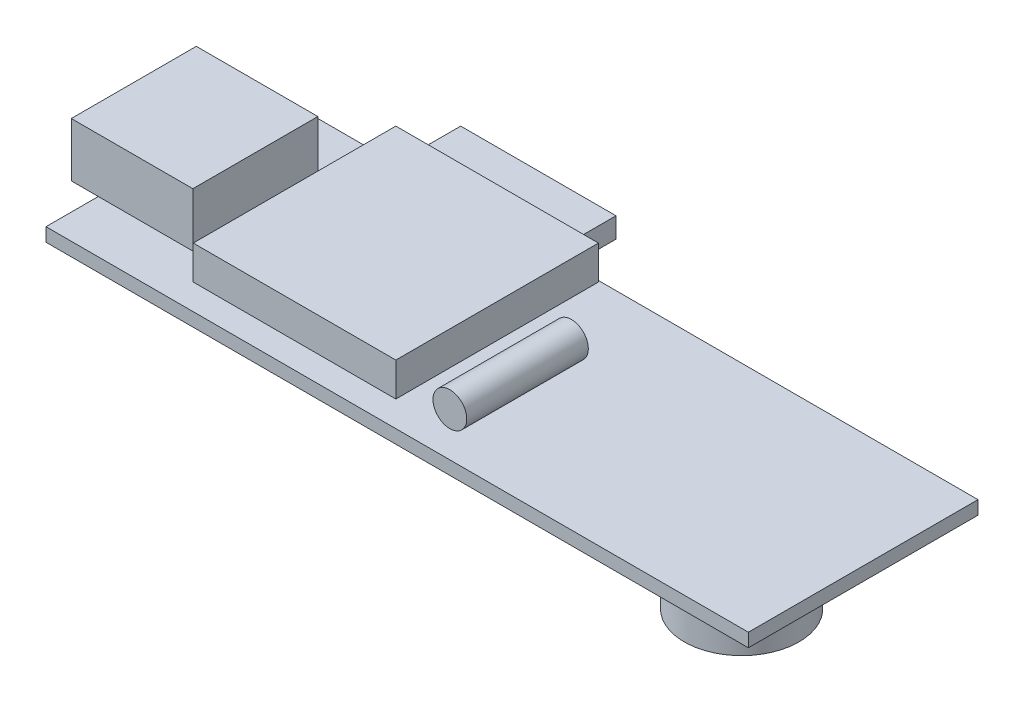
ISO-10303-21;
HEADER;
FILE_DESCRIPTION(('STEP AP214'),'2;1');
FILE_NAME('part.step','',(''),(''),'','','');
FILE_SCHEMA(('AUTOMOTIVE_DESIGN { 1 0 10303 214 1 1 1 1 }'));
ENDSEC;
DATA;
#1=APPLICATION_CONTEXT('core data for automotive mechanical design processes');
#2=APPLICATION_PROTOCOL_DEFINITION('international standard','automotive_design',2000,#1);
#3=PRODUCT_CONTEXT('',#1,'mechanical');
#4=PRODUCT('Part','Part','',(#3));
#5=PRODUCT_RELATED_PRODUCT_CATEGORY('part','',(#4));
#6=PRODUCT_DEFINITION_FORMATION('','',#4);
#7=PRODUCT_DEFINITION_CONTEXT('part definition',#1,'design');
#8=PRODUCT_DEFINITION('design','',#6,#7);
#9=PRODUCT_DEFINITION_SHAPE('','',#8);
#10=(LENGTH_UNIT() NAMED_UNIT(*) SI_UNIT(.MILLI.,.METRE.));
#11=(NAMED_UNIT(*) PLANE_ANGLE_UNIT() SI_UNIT($,.RADIAN.));
#12=(NAMED_UNIT(*) SI_UNIT($,.STERADIAN.) SOLID_ANGLE_UNIT());
#13=UNCERTAINTY_MEASURE_WITH_UNIT(LENGTH_MEASURE(1.E-05),#10,'distance_accuracy_value','');
#14=(GEOMETRIC_REPRESENTATION_CONTEXT(3) GLOBAL_UNCERTAINTY_ASSIGNED_CONTEXT((#13)) GLOBAL_UNIT_ASSIGNED_CONTEXT((#10,
#11,#12)) REPRESENTATION_CONTEXT('',''));
#15=CARTESIAN_POINT('',(0.,0.,0.));
#16=DIRECTION('',(0.,0.,1.));
#17=DIRECTION('',(1.,0.,0.));
#18=AXIS2_PLACEMENT_3D('',#15,#16,#17);
#19=CARTESIAN_POINT('',(-492.,2.35,-284.151572327044));
#20=DIRECTION('',(0.,0.,1.));
#21=DIRECTION('',(1.,0.,0.));
#22=AXIS2_PLACEMENT_3D('',#19,#20,#21);
#23=CYLINDRICAL_SURFACE('',#22,1.24999999999996);
#24=CARTESIAN_POINT('',(-492.,2.35,-284.151572327044));
#25=DIRECTION('',(0.,0.,1.));
#26=DIRECTION('',(1.,0.,0.));
#27=AXIS2_PLACEMENT_3D('',#24,#25,#26);
#28=CIRCLE('',#27,1.24999999999996);
#29=CARTESIAN_POINT('',(-490.75,2.35,-284.151572327044));
#30=VERTEX_POINT('',#29);
#31=EDGE_CURVE('E13',#30,#30,#28,.T.);
#32=ORIENTED_EDGE('',*,*,#31,.T.);
#33=EDGE_LOOP('',(#32));
#34=FACE_BOUND('',#33,.T.);
#35=CARTESIAN_POINT('',(-492.,2.35,-275.151572327044));
#36=DIRECTION('',(0.,0.,1.));
#37=DIRECTION('',(1.,0.,0.));
#38=AXIS2_PLACEMENT_3D('',#35,#36,#37);
#39=CIRCLE('',#38,1.24999999999996);
#40=CARTESIAN_POINT('',(-490.75,2.35,-275.151572327044));
#41=VERTEX_POINT('',#40);
#42=EDGE_CURVE('E59',#41,#41,#39,.T.);
#43=ORIENTED_EDGE('',*,*,#42,.F.);
#44=EDGE_LOOP('',(#43));
#45=FACE_BOUND('',#44,.T.);
#46=ADVANCED_FACE('F56',(#34,#45),#23,.T.);
#47=CARTESIAN_POINT('',(0.,0.,-284.151572327044));
#48=DIRECTION('',(0.,0.,1.));
#49=DIRECTION('',(1.,0.,0.));
#50=AXIS2_PLACEMENT_3D('',#47,#48,#49);
#51=PLANE('',#50);
#52=ORIENTED_EDGE('',*,*,#31,.F.);
#53=EDGE_LOOP('',(#52));
#54=FACE_BOUND('',#53,.T.);
#55=ADVANCED_FACE('F71',(#54),#51,.F.);
#56=CARTESIAN_POINT('',(0.,0.,-275.151572327044));
#57=DIRECTION('',(0.,0.,1.));
#58=DIRECTION('',(1.,0.,0.));
#59=AXIS2_PLACEMENT_3D('',#56,#57,#58);
#60=PLANE('',#59);
#61=ORIENTED_EDGE('',*,*,#42,.T.);
#62=EDGE_LOOP('',(#61));
#63=FACE_BOUND('',#62,.T.);
#64=ADVANCED_FACE('F68',(#63),#60,.T.);
#65=CLOSED_SHELL('',(#46,#55,#64));
#66=MANIFOLD_SOLID_BREP('B2',#65);
#67=CARTESIAN_POINT('',(0.,0.,0.));
#68=DIRECTION('',(0.,1.,0.));
#69=DIRECTION('',(0.,0.,1.));
#70=AXIS2_PLACEMENT_3D('',#67,#68,#69);
#71=PLANE('',#70);
#72=DIRECTION('',(0.,0.,1.));
#73=VECTOR('',#72,1.);
#74=CARTESIAN_POINT('',(-473.,0.,-277.751572327044));
#75=LINE('',#74,#73);
#76=CARTESIAN_POINT('',(-473.,0.,-286.251572327044));
#77=VERTEX_POINT('',#76);
#78=CARTESIAN_POINT('',(-473.,0.,-277.751572327044));
#79=VERTEX_POINT('',#78);
#80=EDGE_CURVE('E308',#77,#79,#75,.T.);
#81=ORIENTED_EDGE('',*,*,#80,.F.);
#82=DIRECTION('',(1.,0.,0.));
#83=VECTOR('',#82,1.);
#84=CARTESIAN_POINT('',(-473.,0.,-286.251572327044));
#85=LINE('',#84,#83);
#86=CARTESIAN_POINT('',(-481.5,0.,-286.251572327044));
#87=VERTEX_POINT('',#86);
#88=EDGE_CURVE('E334',#87,#77,#85,.T.);
#89=ORIENTED_EDGE('',*,*,#88,.F.);
#90=DIRECTION('',(0.,0.,-1.));
#91=VECTOR('',#90,1.);
#92=CARTESIAN_POINT('',(-481.5,0.,-277.751572327044));
#93=LINE('',#92,#91);
#94=CARTESIAN_POINT('',(-481.5,0.,-277.751572327044));
#95=VERTEX_POINT('',#94);
#96=EDGE_CURVE('E331',#95,#87,#93,.T.);
#97=ORIENTED_EDGE('',*,*,#96,.F.);
#98=DIRECTION('',(-1.,0.,0.));
#99=VECTOR('',#98,1.);
#100=CARTESIAN_POINT('',(-473.,0.,-277.751572327044));
#101=LINE('',#100,#99);
#102=EDGE_CURVE('E328',#79,#95,#101,.T.);
#103=ORIENTED_EDGE('',*,*,#102,.F.);
#104=EDGE_LOOP('',(#81,#89,#97,#103));
#105=FACE_BOUND('',#104,.T.);
#106=DIRECTION('',(0.,0.,-1.));
#107=VECTOR('',#106,1.);
#108=CARTESIAN_POINT('',(-468.,0.,-290.251572327044));
#109=LINE('',#108,#107);
#110=CARTESIAN_POINT('',(-468.,0.,-273.251572327044));
#111=VERTEX_POINT('',#110);
#112=CARTESIAN_POINT('',(-468.,0.,-290.251572327044));
#113=VERTEX_POINT('',#112);
#114=EDGE_CURVE('E445',#111,#113,#109,.T.);
#115=ORIENTED_EDGE('',*,*,#114,.F.);
#116=DIRECTION('',(1.,0.,0.));
#117=VECTOR('',#116,1.);
#118=CARTESIAN_POINT('',(-520.,0.,-273.251572327044));
#119=LINE('',#118,#117);
#120=CARTESIAN_POINT('',(-520.,0.,-273.251572327044));
#121=VERTEX_POINT('',#120);
#122=EDGE_CURVE('E450',#121,#111,#119,.T.);
#123=ORIENTED_EDGE('',*,*,#122,.F.);
#124=DIRECTION('',(0.,0.,1.));
#125=VECTOR('',#124,1.);
#126=CARTESIAN_POINT('',(-520.,0.,-290.251572327044));
#127=LINE('',#126,#125);
#128=CARTESIAN_POINT('',(-520.,0.,-290.251572327044));
#129=VERTEX_POINT('',#128);
#130=EDGE_CURVE('E464',#129,#121,#127,.T.);
#131=ORIENTED_EDGE('',*,*,#130,.F.);
#132=DIRECTION('',(-1.,0.,0.));
#133=VECTOR('',#132,1.);
#134=CARTESIAN_POINT('',(-520.,0.,-290.251572327044));
#135=LINE('',#134,#133);
#136=EDGE_CURVE('E462',#113,#129,#135,.T.);
#137=ORIENTED_EDGE('',*,*,#136,.F.);
#138=EDGE_LOOP('',(#115,#123,#131,#137));
#139=FACE_BOUND('',#138,.T.);
#140=DIRECTION('',(0.,0.,-1.));
#141=VECTOR('',#140,1.);
#142=CARTESIAN_POINT('',(-503.639826364292,0.,-286.106319297367));
#143=LINE('',#142,#141);
#144=CARTESIAN_POINT('',(-503.639826364292,0.,-277.2478310739));
#145=VERTEX_POINT('',#144);
#146=CARTESIAN_POINT('',(-503.639826364292,0.,-286.106319297367));
#147=VERTEX_POINT('',#146);
#148=EDGE_CURVE('E298',#145,#147,#143,.T.);
#149=ORIENTED_EDGE('',*,*,#148,.F.);
#150=DIRECTION('',(-1.,0.,0.));
#151=VECTOR('',#150,1.);
#152=CARTESIAN_POINT('',(-503.639826364292,0.,-277.2478310739));
#153=LINE('',#152,#151);
#154=CARTESIAN_POINT('',(-492.095752369323,0.,-277.2478310739));
#155=VERTEX_POINT('',#154);
#156=EDGE_CURVE('E295',#155,#145,#153,.T.);
#157=ORIENTED_EDGE('',*,*,#156,.F.);
#158=DIRECTION('',(0.,0.,1.));
#159=VECTOR('',#158,1.);
#160=CARTESIAN_POINT('',(-492.095752369323,0.,-286.106319297367));
#161=LINE('',#160,#159);
#162=CARTESIAN_POINT('',(-492.095752369323,0.,-286.106319297367));
#163=VERTEX_POINT('',#162);
#164=EDGE_CURVE('E119',#163,#155,#161,.T.);
#165=ORIENTED_EDGE('',*,*,#164,.F.);
#166=DIRECTION('',(1.,0.,0.));
#167=VECTOR('',#166,1.);
#168=CARTESIAN_POINT('',(-503.639826364292,0.,-286.106319297367));
#169=LINE('',#168,#167);
#170=EDGE_CURVE('E114',#147,#163,#169,.T.);
#171=ORIENTED_EDGE('',*,*,#170,.F.);
#172=EDGE_LOOP('',(#149,#157,#165,#171));
#173=FACE_BOUND('',#172,.T.);
#174=ADVANCED_FACE('F96',(#105,#139,#173),#71,.F.);
#175=CARTESIAN_POINT('',(0.,-3.5,0.));
#176=DIRECTION('',(0.,1.,0.));
#177=DIRECTION('',(0.,0.,1.));
#178=AXIS2_PLACEMENT_3D('',#175,#176,#177);
#179=PLANE('',#178);
#180=CARTESIAN_POINT('',(-477.25,-3.5,-282.001572327044));
#181=DIRECTION('',(0.,-1.,0.));
#182=DIRECTION('',(0.,0.,-1.));
#183=AXIS2_PLACEMENT_3D('',#180,#181,#182);
#184=CIRCLE('',#183,4.24999999999995);
#185=CARTESIAN_POINT('',(-477.25,-3.5,-286.251572327044));
#186=VERTEX_POINT('',#185);
#187=CARTESIAN_POINT('',(-473.,-3.5,-282.001572327044));
#188=VERTEX_POINT('',#187);
#189=EDGE_CURVE('E107',#186,#188,#184,.T.);
#190=ORIENTED_EDGE('',*,*,#189,.F.);
#191=DIRECTION('',(1.,0.,0.));
#192=VECTOR('',#191,1.);
#193=CARTESIAN_POINT('',(-473.,-3.5,-286.251572327044));
#194=LINE('',#193,#192);
#195=CARTESIAN_POINT('',(-473.,-3.5,-286.251572327044));
#196=VERTEX_POINT('',#195);
#197=EDGE_CURVE('E322',#186,#196,#194,.T.);
#198=ORIENTED_EDGE('',*,*,#197,.T.);
#199=DIRECTION('',(0.,0.,1.));
#200=VECTOR('',#199,1.);
#201=CARTESIAN_POINT('',(-473.,-3.5,-277.751572327044));
#202=LINE('',#201,#200);
#203=EDGE_CURVE('E310',#196,#188,#202,.T.);
#204=ORIENTED_EDGE('',*,*,#203,.T.);
#205=EDGE_LOOP('',(#190,#198,#204));
#206=FACE_BOUND('',#205,.T.);
#207=ADVANCED_FACE('F506',(#206),#179,.F.);
#208=CARTESIAN_POINT('',(-477.25,-3.5,-277.751572327044));
#209=VERTEX_POINT('',#208);
#210=EDGE_CURVE('E54',#188,#209,#184,.T.);
#211=ORIENTED_EDGE('',*,*,#210,.F.);
#212=CARTESIAN_POINT('',(-473.,-3.5,-277.751572327044));
#213=VERTEX_POINT('',#212);
#214=EDGE_CURVE('E314',#188,#213,#202,.T.);
#215=ORIENTED_EDGE('',*,*,#214,.T.);
#216=DIRECTION('',(-1.,0.,0.));
#217=VECTOR('',#216,1.);
#218=CARTESIAN_POINT('',(-473.,-3.5,-277.751572327044));
#219=LINE('',#218,#217);
#220=EDGE_CURVE('E315',#213,#209,#219,.T.);
#221=ORIENTED_EDGE('',*,*,#220,.T.);
#222=EDGE_LOOP('',(#211,#215,#221));
#223=FACE_BOUND('',#222,.T.);
#224=ADVANCED_FACE('F499',(#223),#179,.F.);
#225=CARTESIAN_POINT('',(-481.5,-3.5,-282.001572327044));
#226=VERTEX_POINT('',#225);
#227=EDGE_CURVE('E105',#209,#226,#184,.T.);
#228=ORIENTED_EDGE('',*,*,#227,.F.);
#229=CARTESIAN_POINT('',(-481.5,-3.5,-277.751572327044));
#230=VERTEX_POINT('',#229);
#231=EDGE_CURVE('E313',#209,#230,#219,.T.);
#232=ORIENTED_EDGE('',*,*,#231,.T.);
#233=DIRECTION('',(0.,0.,-1.));
#234=VECTOR('',#233,1.);
#235=CARTESIAN_POINT('',(-481.5,-3.5,-277.751572327044));
#236=LINE('',#235,#234);
#237=EDGE_CURVE('E319',#230,#226,#236,.T.);
#238=ORIENTED_EDGE('',*,*,#237,.T.);
#239=EDGE_LOOP('',(#228,#232,#238));
#240=FACE_BOUND('',#239,.T.);
#241=ADVANCED_FACE('F491',(#240),#179,.F.);
#242=CARTESIAN_POINT('',(-496.,3.5,-290.151572327044));
#243=DIRECTION('',(0.,0.,1.));
#244=DIRECTION('',(1.,0.,0.));
#245=AXIS2_PLACEMENT_3D('',#242,#243,#244);
#246=PLANE('',#245);
#247=DIRECTION('',(-1.,0.,0.));
#248=VECTOR('',#247,1.);
#249=CARTESIAN_POINT('',(-496.,1.,-290.151572327044));
#250=LINE('',#249,#248);
#251=CARTESIAN_POINT('',(-496.,1.,-290.151572327044));
#252=VERTEX_POINT('',#251);
#253=CARTESIAN_POINT('',(-511.,1.,-290.151572327044));
#254=VERTEX_POINT('',#253);
#255=EDGE_CURVE('E395',#252,#254,#250,.T.);
#256=ORIENTED_EDGE('',*,*,#255,.T.);
#257=DIRECTION('',(0.,-1.,0.));
#258=VECTOR('',#257,1.);
#259=CARTESIAN_POINT('',(-511.,3.5,-290.151572327044));
#260=LINE('',#259,#258);
#261=CARTESIAN_POINT('',(-511.,3.5,-290.151572327044));
#262=VERTEX_POINT('',#261);
#263=EDGE_CURVE('E405',#262,#254,#260,.T.);
#264=ORIENTED_EDGE('',*,*,#263,.F.);
#265=DIRECTION('',(-1.,0.,0.));
#266=VECTOR('',#265,1.);
#267=CARTESIAN_POINT('',(-496.,3.5,-290.151572327044));
#268=LINE('',#267,#266);
#269=CARTESIAN_POINT('',(-496.,3.5,-290.151572327044));
#270=VERTEX_POINT('',#269);
#271=EDGE_CURVE('E385',#270,#262,#268,.T.);
#272=ORIENTED_EDGE('',*,*,#271,.F.);
#273=DIRECTION('',(0.,-1.,0.));
#274=VECTOR('',#273,1.);
#275=CARTESIAN_POINT('',(-496.,3.5,-290.151572327044));
#276=LINE('',#275,#274);
#277=EDGE_CURVE('E408',#270,#252,#276,.T.);
#278=ORIENTED_EDGE('',*,*,#277,.T.);
#279=EDGE_LOOP('',(#256,#264,#272,#278));
#280=FACE_BOUND('',#279,.T.);
#281=DIRECTION('',(0.,1.,0.));
#282=VECTOR('',#281,1.);
#283=CARTESIAN_POINT('',(-508.7,1.9,-290.151572327044));
#284=LINE('',#283,#282);
#285=CARTESIAN_POINT('',(-508.7,1.9,-290.151572327044));
#286=VERTEX_POINT('',#285);
#287=CARTESIAN_POINT('',(-508.7,3.4,-290.151572327044));
#288=VERTEX_POINT('',#287);
#289=EDGE_CURVE('E348',#286,#288,#284,.T.);
#290=ORIENTED_EDGE('',*,*,#289,.F.);
#291=DIRECTION('',(-1.,0.,0.));
#292=VECTOR('',#291,1.);
#293=CARTESIAN_POINT('',(-508.7,1.9,-290.151572327044));
#294=LINE('',#293,#292);
#295=CARTESIAN_POINT('',(-497.2,1.9,-290.151572327044));
#296=VERTEX_POINT('',#295);
#297=EDGE_CURVE('E353',#296,#286,#294,.T.);
#298=ORIENTED_EDGE('',*,*,#297,.F.);
#299=DIRECTION('',(0.,-1.,0.));
#300=VECTOR('',#299,1.);
#301=CARTESIAN_POINT('',(-497.2,1.9,-290.151572327044));
#302=LINE('',#301,#300);
#303=CARTESIAN_POINT('',(-497.2,3.4,-290.151572327044));
#304=VERTEX_POINT('',#303);
#305=EDGE_CURVE('E365',#304,#296,#302,.T.);
#306=ORIENTED_EDGE('',*,*,#305,.F.);
#307=DIRECTION('',(1.,0.,0.));
#308=VECTOR('',#307,1.);
#309=CARTESIAN_POINT('',(-508.7,3.4,-290.151572327044));
#310=LINE('',#309,#308);
#311=EDGE_CURVE('E362',#288,#304,#310,.T.);
#312=ORIENTED_EDGE('',*,*,#311,.F.);
#313=EDGE_LOOP('',(#290,#298,#306,#312));
#314=FACE_BOUND('',#313,.T.);
#315=ADVANCED_FACE('F532',(#280,#314),#246,.F.);
#316=CARTESIAN_POINT('',(0.,1.,0.));
#317=DIRECTION('',(0.,1.,0.));
#318=DIRECTION('',(0.,0.,1.));
#319=AXIS2_PLACEMENT_3D('',#316,#317,#318);
#320=PLANE('',#319);
#321=DIRECTION('',(0.,0.,1.));
#322=VECTOR('',#321,1.);
#323=CARTESIAN_POINT('',(-520.,1.,-290.251572327044));
#324=LINE('',#323,#322);
#325=CARTESIAN_POINT('',(-520.,1.,-290.251572327044));
#326=VERTEX_POINT('',#325);
#327=CARTESIAN_POINT('',(-520.,1.,-286.37932786081));
#328=VERTEX_POINT('',#327);
#329=EDGE_CURVE('E453',#326,#328,#324,.T.);
#330=ORIENTED_EDGE('',*,*,#329,.T.);
#331=DIRECTION('',(1.,0.,0.));
#332=VECTOR('',#331,1.);
#333=CARTESIAN_POINT('',(0.,1.,-286.37932786081));
#334=LINE('',#333,#332);
#335=CARTESIAN_POINT('',(-513.,1.,-286.37932786081));
#336=VERTEX_POINT('',#335);
#337=EDGE_CURVE('E434',#328,#336,#334,.T.);
#338=ORIENTED_EDGE('',*,*,#337,.T.);
#339=DIRECTION('',(0.,0.,1.));
#340=VECTOR('',#339,1.);
#341=CARTESIAN_POINT('',(-513.,1.,0.));
#342=LINE('',#341,#340);
#343=CARTESIAN_POINT('',(-513.,1.,-277.123816793278));
#344=VERTEX_POINT('',#343);
#345=EDGE_CURVE('E429',#336,#344,#342,.T.);
#346=ORIENTED_EDGE('',*,*,#345,.T.);
#347=DIRECTION('',(1.,0.,0.));
#348=VECTOR('',#347,1.);
#349=CARTESIAN_POINT('',(0.,1.,-277.123816793278));
#350=LINE('',#349,#348);
#351=CARTESIAN_POINT('',(-520.,1.,-277.123816793278));
#352=VERTEX_POINT('',#351);
#353=EDGE_CURVE('E430',#352,#344,#350,.T.);
#354=ORIENTED_EDGE('',*,*,#353,.F.);
#355=CARTESIAN_POINT('',(-520.,1.,-273.251572327044));
#356=VERTEX_POINT('',#355);
#357=EDGE_CURVE('E452',#352,#356,#324,.T.);
#358=ORIENTED_EDGE('',*,*,#357,.T.);
#359=DIRECTION('',(1.,0.,0.));
#360=VECTOR('',#359,1.);
#361=CARTESIAN_POINT('',(-520.,1.,-273.251572327044));
#362=LINE('',#361,#360);
#363=CARTESIAN_POINT('',(-468.,1.,-273.251572327044));
#364=VERTEX_POINT('',#363);
#365=EDGE_CURVE('E456',#356,#364,#362,.T.);
#366=ORIENTED_EDGE('',*,*,#365,.T.);
#367=DIRECTION('',(0.,0.,-1.));
#368=VECTOR('',#367,1.);
#369=CARTESIAN_POINT('',(-468.,1.,-290.251572327044));
#370=LINE('',#369,#368);
#371=CARTESIAN_POINT('',(-468.,1.,-290.251572327044));
#372=VERTEX_POINT('',#371);
#373=EDGE_CURVE('E446',#364,#372,#370,.T.);
#374=ORIENTED_EDGE('',*,*,#373,.T.);
#375=DIRECTION('',(-1.,0.,0.));
#376=VECTOR('',#375,1.);
#377=CARTESIAN_POINT('',(-520.,1.,-290.251572327044));
#378=LINE('',#377,#376);
#379=EDGE_CURVE('E449',#372,#326,#378,.T.);
#380=ORIENTED_EDGE('',*,*,#379,.T.);
#381=EDGE_LOOP('',(#330,#338,#346,#354,#358,#366,#374,#380));
#382=FACE_BOUND('',#381,.T.);
#383=ORIENTED_EDGE('',*,*,#255,.F.);
#384=DIRECTION('',(0.,0.,-1.));
#385=VECTOR('',#384,1.);
#386=CARTESIAN_POINT('',(-496.,1.,-275.151572327044));
#387=LINE('',#386,#385);
#388=CARTESIAN_POINT('',(-496.,1.,-275.151572327044));
#389=VERTEX_POINT('',#388);
#390=EDGE_CURVE('E381',#389,#252,#387,.T.);
#391=ORIENTED_EDGE('',*,*,#390,.F.);
#392=DIRECTION('',(1.,0.,0.));
#393=VECTOR('',#392,1.);
#394=CARTESIAN_POINT('',(-496.,1.,-275.151572327044));
#395=LINE('',#394,#393);
#396=CARTESIAN_POINT('',(-511.,1.,-275.151572327044));
#397=VERTEX_POINT('',#396);
#398=EDGE_CURVE('E386',#397,#389,#395,.T.);
#399=ORIENTED_EDGE('',*,*,#398,.F.);
#400=DIRECTION('',(0.,0.,1.));
#401=VECTOR('',#400,1.);
#402=CARTESIAN_POINT('',(-511.,1.,-275.151572327044));
#403=LINE('',#402,#401);
#404=EDGE_CURVE('E397',#254,#397,#403,.T.);
#405=ORIENTED_EDGE('',*,*,#404,.F.);
#406=EDGE_LOOP('',(#383,#391,#399,#405));
#407=FACE_BOUND('',#406,.T.);
#408=ADVANCED_FACE('F539',(#382,#407),#320,.T.);
#409=CARTESIAN_POINT('',(-468.,1.,-290.251572327044));
#410=DIRECTION('',(-1.,0.,0.));
#411=DIRECTION('',(0.,0.,1.));
#412=AXIS2_PLACEMENT_3D('',#409,#410,#411);
#413=PLANE('',#412);
#414=ORIENTED_EDGE('',*,*,#114,.T.);
#415=DIRECTION('',(0.,-1.,0.));
#416=VECTOR('',#415,1.);
#417=CARTESIAN_POINT('',(-468.,1.,-290.251572327044));
#418=LINE('',#417,#416);
#419=EDGE_CURVE('E100',#372,#113,#418,.T.);
#420=ORIENTED_EDGE('',*,*,#419,.F.);
#421=ORIENTED_EDGE('',*,*,#373,.F.);
#422=DIRECTION('',(0.,-1.,0.));
#423=VECTOR('',#422,1.);
#424=CARTESIAN_POINT('',(-468.,1.,-273.251572327044));
#425=LINE('',#424,#423);
#426=EDGE_CURVE('E459',#364,#111,#425,.T.);
#427=ORIENTED_EDGE('',*,*,#426,.T.);
#428=EDGE_LOOP('',(#414,#420,#421,#427));
#429=FACE_BOUND('',#428,.T.);
#430=ADVANCED_FACE('F98',(#429),#413,.F.);
#431=CARTESIAN_POINT('',(-520.,1.,-290.251572327044));
#432=DIRECTION('',(0.,0.,1.));
#433=DIRECTION('',(1.,0.,0.));
#434=AXIS2_PLACEMENT_3D('',#431,#432,#433);
#435=PLANE('',#434);
#436=ORIENTED_EDGE('',*,*,#136,.T.);
#437=DIRECTION('',(0.,-1.,0.));
#438=VECTOR('',#437,1.);
#439=CARTESIAN_POINT('',(-520.,1.,-290.251572327044));
#440=LINE('',#439,#438);
#441=EDGE_CURVE('E471',#326,#129,#440,.T.);
#442=ORIENTED_EDGE('',*,*,#441,.F.);
#443=ORIENTED_EDGE('',*,*,#379,.F.);
#444=ORIENTED_EDGE('',*,*,#419,.T.);
#445=EDGE_LOOP('',(#436,#442,#443,#444));
#446=FACE_BOUND('',#445,.T.);
#447=ADVANCED_FACE('F548',(#446),#435,.F.);
#448=CARTESIAN_POINT('',(-520.,1.,-290.251572327044));
#449=DIRECTION('',(1.,0.,0.));
#450=DIRECTION('',(0.,0.,-1.));
#451=AXIS2_PLACEMENT_3D('',#448,#449,#450);
#452=PLANE('',#451);
#453=ORIENTED_EDGE('',*,*,#130,.T.);
#454=DIRECTION('',(0.,-1.,0.));
#455=VECTOR('',#454,1.);
#456=CARTESIAN_POINT('',(-520.,1.,-273.251572327044));
#457=LINE('',#456,#455);
#458=EDGE_CURVE('E469',#356,#121,#457,.T.);
#459=ORIENTED_EDGE('',*,*,#458,.F.);
#460=ORIENTED_EDGE('',*,*,#357,.F.);
#461=EDGE_CURVE('E457',#328,#352,#324,.T.);
#462=ORIENTED_EDGE('',*,*,#461,.F.);
#463=ORIENTED_EDGE('',*,*,#329,.F.);
#464=ORIENTED_EDGE('',*,*,#441,.T.);
#465=EDGE_LOOP('',(#453,#459,#460,#462,#463,#464));
#466=FACE_BOUND('',#465,.T.);
#467=ADVANCED_FACE('F545',(#466),#452,.F.);
#468=CARTESIAN_POINT('',(-520.,1.,-273.251572327044));
#469=DIRECTION('',(0.,0.,-1.));
#470=DIRECTION('',(-1.,0.,0.));
#471=AXIS2_PLACEMENT_3D('',#468,#469,#470);
#472=PLANE('',#471);
#473=ORIENTED_EDGE('',*,*,#122,.T.);
#474=ORIENTED_EDGE('',*,*,#426,.F.);
#475=ORIENTED_EDGE('',*,*,#365,.F.);
#476=ORIENTED_EDGE('',*,*,#458,.T.);
#477=EDGE_LOOP('',(#473,#474,#475,#476));
#478=FACE_BOUND('',#477,.T.);
#479=ADVANCED_FACE('F541',(#478),#472,.F.);
#480=CARTESIAN_POINT('',(0.,1.,0.));
#481=DIRECTION('',(0.,1.,0.));
#482=DIRECTION('',(0.,0.,1.));
#483=AXIS2_PLACEMENT_3D('',#480,#481,#482);
#484=PLANE('',#483);
#485=CARTESIAN_POINT('',(-522.,1.,-286.37932786081));
#486=VERTEX_POINT('',#485);
#487=EDGE_CURVE('E415',#486,#328,#334,.T.);
#488=ORIENTED_EDGE('',*,*,#487,.T.);
#489=ORIENTED_EDGE('',*,*,#461,.T.);
#490=CARTESIAN_POINT('',(-522.,1.,-277.123816793278));
#491=VERTEX_POINT('',#490);
#492=EDGE_CURVE('E426',#491,#352,#350,.T.);
#493=ORIENTED_EDGE('',*,*,#492,.F.);
#494=DIRECTION('',(0.,0.,1.));
#495=VECTOR('',#494,1.);
#496=CARTESIAN_POINT('',(-522.,1.,0.));
#497=LINE('',#496,#495);
#498=EDGE_CURVE('E410',#486,#491,#497,.T.);
#499=ORIENTED_EDGE('',*,*,#498,.F.);
#500=EDGE_LOOP('',(#488,#489,#493,#499));
#501=FACE_BOUND('',#500,.T.);
#502=ADVANCED_FACE('F544',(#501),#484,.F.);
#503=CARTESIAN_POINT('',(-522.,5.,0.));
#504=DIRECTION('',(1.,0.,0.));
#505=DIRECTION('',(0.,0.,-1.));
#506=AXIS2_PLACEMENT_3D('',#503,#504,#505);
#507=PLANE('',#506);
#508=ORIENTED_EDGE('',*,*,#498,.T.);
#509=DIRECTION('',(0.,-1.,0.));
#510=VECTOR('',#509,1.);
#511=CARTESIAN_POINT('',(-522.,5.,-277.123816793278));
#512=LINE('',#511,#510);
#513=CARTESIAN_POINT('',(-522.,5.,-277.123816793278));
#514=VERTEX_POINT('',#513);
#515=EDGE_CURVE('E442',#514,#491,#512,.T.);
#516=ORIENTED_EDGE('',*,*,#515,.F.);
#517=DIRECTION('',(0.,0.,1.));
#518=VECTOR('',#517,1.);
#519=CARTESIAN_POINT('',(-522.,5.,0.));
#520=LINE('',#519,#518);
#521=CARTESIAN_POINT('',(-522.,5.,-286.37932786081));
#522=VERTEX_POINT('',#521);
#523=EDGE_CURVE('E411',#522,#514,#520,.T.);
#524=ORIENTED_EDGE('',*,*,#523,.F.);
#525=DIRECTION('',(0.,-1.,0.));
#526=VECTOR('',#525,1.);
#527=CARTESIAN_POINT('',(-522.,5.,-286.37932786081));
#528=LINE('',#527,#526);
#529=EDGE_CURVE('E423',#522,#486,#528,.T.);
#530=ORIENTED_EDGE('',*,*,#529,.T.);
#531=EDGE_LOOP('',(#508,#516,#524,#530));
#532=FACE_BOUND('',#531,.T.);
#533=ADVANCED_FACE('F570',(#532),#507,.F.);
#534=CARTESIAN_POINT('',(0.,5.,-277.123816793278));
#535=DIRECTION('',(0.,0.,-1.));
#536=DIRECTION('',(-1.,0.,0.));
#537=AXIS2_PLACEMENT_3D('',#534,#535,#536);
#538=PLANE('',#537);
#539=ORIENTED_EDGE('',*,*,#492,.T.);
#540=ORIENTED_EDGE('',*,*,#353,.T.);
#541=DIRECTION('',(0.,-1.,0.));
#542=VECTOR('',#541,1.);
#543=CARTESIAN_POINT('',(-513.,5.,-277.123816793278));
#544=LINE('',#543,#542);
#545=CARTESIAN_POINT('',(-513.,5.,-277.123816793278));
#546=VERTEX_POINT('',#545);
#547=EDGE_CURVE('E439',#546,#344,#544,.T.);
#548=ORIENTED_EDGE('',*,*,#547,.F.);
#549=DIRECTION('',(1.,0.,0.));
#550=VECTOR('',#549,1.);
#551=CARTESIAN_POINT('',(0.,5.,-277.123816793278));
#552=LINE('',#551,#550);
#553=EDGE_CURVE('E414',#514,#546,#552,.T.);
#554=ORIENTED_EDGE('',*,*,#553,.F.);
#555=ORIENTED_EDGE('',*,*,#515,.T.);
#556=EDGE_LOOP('',(#539,#540,#548,#554,#555));
#557=FACE_BOUND('',#556,.T.);
#558=ADVANCED_FACE('F566',(#557),#538,.F.);
#559=CARTESIAN_POINT('',(-513.,5.,0.));
#560=DIRECTION('',(1.,0.,0.));
#561=DIRECTION('',(0.,0.,-1.));
#562=AXIS2_PLACEMENT_3D('',#559,#560,#561);
#563=PLANE('',#562);
#564=ORIENTED_EDGE('',*,*,#345,.F.);
#565=DIRECTION('',(0.,-1.,0.));
#566=VECTOR('',#565,1.);
#567=CARTESIAN_POINT('',(-513.,5.,-286.37932786081));
#568=LINE('',#567,#566);
#569=CARTESIAN_POINT('',(-513.,5.,-286.37932786081));
#570=VERTEX_POINT('',#569);
#571=EDGE_CURVE('E436',#570,#336,#568,.T.);
#572=ORIENTED_EDGE('',*,*,#571,.F.);
#573=DIRECTION('',(0.,0.,1.));
#574=VECTOR('',#573,1.);
#575=CARTESIAN_POINT('',(-513.,5.,0.));
#576=LINE('',#575,#574);
#577=EDGE_CURVE('E417',#570,#546,#576,.T.);
#578=ORIENTED_EDGE('',*,*,#577,.T.);
#579=ORIENTED_EDGE('',*,*,#547,.T.);
#580=EDGE_LOOP('',(#564,#572,#578,#579));
#581=FACE_BOUND('',#580,.T.);
#582=ADVANCED_FACE('F577',(#581),#563,.T.);
#583=CARTESIAN_POINT('',(0.,5.,-286.37932786081));
#584=DIRECTION('',(0.,0.,-1.));
#585=DIRECTION('',(-1.,0.,0.));
#586=AXIS2_PLACEMENT_3D('',#583,#584,#585);
#587=PLANE('',#586);
#588=ORIENTED_EDGE('',*,*,#487,.F.);
#589=ORIENTED_EDGE('',*,*,#529,.F.);
#590=DIRECTION('',(1.,0.,0.));
#591=VECTOR('',#590,1.);
#592=CARTESIAN_POINT('',(0.,5.,-286.37932786081));
#593=LINE('',#592,#591);
#594=EDGE_CURVE('E420',#522,#570,#593,.T.);
#595=ORIENTED_EDGE('',*,*,#594,.T.);
#596=ORIENTED_EDGE('',*,*,#571,.T.);
#597=ORIENTED_EDGE('',*,*,#337,.F.);
#598=EDGE_LOOP('',(#588,#589,#595,#596,#597));
#599=FACE_BOUND('',#598,.T.);
#600=ADVANCED_FACE('F572',(#599),#587,.T.);
#601=CARTESIAN_POINT('',(0.,5.,0.));
#602=DIRECTION('',(0.,1.,0.));
#603=DIRECTION('',(0.,0.,1.));
#604=AXIS2_PLACEMENT_3D('',#601,#602,#603);
#605=PLANE('',#604);
#606=ORIENTED_EDGE('',*,*,#523,.T.);
#607=ORIENTED_EDGE('',*,*,#553,.T.);
#608=ORIENTED_EDGE('',*,*,#577,.F.);
#609=ORIENTED_EDGE('',*,*,#594,.F.);
#610=EDGE_LOOP('',(#606,#607,#608,#609));
#611=FACE_BOUND('',#610,.T.);
#612=ADVANCED_FACE('F579',(#611),#605,.T.);
#613=CARTESIAN_POINT('',(-496.,3.5,-275.151572327044));
#614=DIRECTION('',(-1.,0.,0.));
#615=DIRECTION('',(0.,0.,1.));
#616=AXIS2_PLACEMENT_3D('',#613,#614,#615);
#617=PLANE('',#616);
#618=ORIENTED_EDGE('',*,*,#390,.T.);
#619=ORIENTED_EDGE('',*,*,#277,.F.);
#620=DIRECTION('',(0.,0.,-1.));
#621=VECTOR('',#620,1.);
#622=CARTESIAN_POINT('',(-496.,3.5,-275.151572327044));
#623=LINE('',#622,#621);
#624=CARTESIAN_POINT('',(-496.,3.5,-275.151572327044));
#625=VERTEX_POINT('',#624);
#626=EDGE_CURVE('E382',#625,#270,#623,.T.);
#627=ORIENTED_EDGE('',*,*,#626,.F.);
#628=DIRECTION('',(0.,-1.,0.));
#629=VECTOR('',#628,1.);
#630=CARTESIAN_POINT('',(-496.,3.5,-275.151572327044));
#631=LINE('',#630,#629);
#632=EDGE_CURVE('E392',#625,#389,#631,.T.);
#633=ORIENTED_EDGE('',*,*,#632,.T.);
#634=EDGE_LOOP('',(#618,#619,#627,#633));
#635=FACE_BOUND('',#634,.T.);
#636=ADVANCED_FACE('F581',(#635),#617,.F.);
#637=CARTESIAN_POINT('',(-511.,3.5,-275.151572327044));
#638=DIRECTION('',(1.,0.,0.));
#639=DIRECTION('',(0.,0.,-1.));
#640=AXIS2_PLACEMENT_3D('',#637,#638,#639);
#641=PLANE('',#640);
#642=ORIENTED_EDGE('',*,*,#404,.T.);
#643=DIRECTION('',(0.,-1.,0.));
#644=VECTOR('',#643,1.);
#645=CARTESIAN_POINT('',(-511.,3.5,-275.151572327044));
#646=LINE('',#645,#644);
#647=CARTESIAN_POINT('',(-511.,3.5,-275.151572327044));
#648=VERTEX_POINT('',#647);
#649=EDGE_CURVE('E403',#648,#397,#646,.T.);
#650=ORIENTED_EDGE('',*,*,#649,.F.);
#651=DIRECTION('',(0.,0.,1.));
#652=VECTOR('',#651,1.);
#653=CARTESIAN_POINT('',(-511.,3.5,-275.151572327044));
#654=LINE('',#653,#652);
#655=EDGE_CURVE('E388',#262,#648,#654,.T.);
#656=ORIENTED_EDGE('',*,*,#655,.F.);
#657=ORIENTED_EDGE('',*,*,#263,.T.);
#658=EDGE_LOOP('',(#642,#650,#656,#657));
#659=FACE_BOUND('',#658,.T.);
#660=ADVANCED_FACE('F587',(#659),#641,.F.);
#661=CARTESIAN_POINT('',(-496.,3.5,-275.151572327044));
#662=DIRECTION('',(0.,0.,-1.));
#663=DIRECTION('',(-1.,0.,0.));
#664=AXIS2_PLACEMENT_3D('',#661,#662,#663);
#665=PLANE('',#664);
#666=ORIENTED_EDGE('',*,*,#398,.T.);
#667=ORIENTED_EDGE('',*,*,#632,.F.);
#668=DIRECTION('',(1.,0.,0.));
#669=VECTOR('',#668,1.);
#670=CARTESIAN_POINT('',(-496.,3.5,-275.151572327044));
#671=LINE('',#670,#669);
#672=EDGE_CURVE('E390',#648,#625,#671,.T.);
#673=ORIENTED_EDGE('',*,*,#672,.F.);
#674=ORIENTED_EDGE('',*,*,#649,.T.);
#675=EDGE_LOOP('',(#666,#667,#673,#674));
#676=FACE_BOUND('',#675,.T.);
#677=ADVANCED_FACE('F643',(#676),#665,.F.);
#678=CARTESIAN_POINT('',(0.,3.5,0.));
#679=DIRECTION('',(0.,1.,0.));
#680=DIRECTION('',(0.,0.,1.));
#681=AXIS2_PLACEMENT_3D('',#678,#679,#680);
#682=PLANE('',#681);
#683=ORIENTED_EDGE('',*,*,#626,.T.);
#684=ORIENTED_EDGE('',*,*,#271,.T.);
#685=ORIENTED_EDGE('',*,*,#655,.T.);
#686=ORIENTED_EDGE('',*,*,#672,.T.);
#687=EDGE_LOOP('',(#683,#684,#685,#686));
#688=FACE_BOUND('',#687,.T.);
#689=ADVANCED_FACE('F653',(#688),#682,.T.);
#690=CARTESIAN_POINT('',(-508.7,1.9,-292.651572327044));
#691=DIRECTION('',(1.,0.,0.));
#692=DIRECTION('',(0.,0.,-1.));
#693=AXIS2_PLACEMENT_3D('',#690,#691,#692);
#694=PLANE('',#693);
#695=ORIENTED_EDGE('',*,*,#289,.T.);
#696=DIRECTION('',(0.,0.,1.));
#697=VECTOR('',#696,1.);
#698=CARTESIAN_POINT('',(-508.7,3.4,-292.651572327044));
#699=LINE('',#698,#697);
#700=CARTESIAN_POINT('',(-508.7,3.4,-292.651572327044));
#701=VERTEX_POINT('',#700);
#702=EDGE_CURVE('E378',#701,#288,#699,.T.);
#703=ORIENTED_EDGE('',*,*,#702,.F.);
#704=DIRECTION('',(0.,1.,0.));
#705=VECTOR('',#704,1.);
#706=CARTESIAN_POINT('',(-508.7,1.9,-292.651572327044));
#707=LINE('',#706,#705);
#708=CARTESIAN_POINT('',(-508.7,1.9,-292.651572327044));
#709=VERTEX_POINT('',#708);
#710=EDGE_CURVE('E349',#709,#701,#707,.T.);
#711=ORIENTED_EDGE('',*,*,#710,.F.);
#712=DIRECTION('',(0.,0.,1.));
#713=VECTOR('',#712,1.);
#714=CARTESIAN_POINT('',(-508.7,1.9,-292.651572327044));
#715=LINE('',#714,#713);
#716=EDGE_CURVE('E359',#709,#286,#715,.T.);
#717=ORIENTED_EDGE('',*,*,#716,.T.);
#718=EDGE_LOOP('',(#695,#703,#711,#717));
#719=FACE_BOUND('',#718,.T.);
#720=ADVANCED_FACE('F663',(#719),#694,.F.);
#721=CARTESIAN_POINT('',(-508.7,3.4,-292.651572327044));
#722=DIRECTION('',(0.,-1.,0.));
#723=DIRECTION('',(1.,0.,0.));
#724=AXIS2_PLACEMENT_3D('',#721,#722,#723);
#725=PLANE('',#724);
#726=ORIENTED_EDGE('',*,*,#311,.T.);
#727=DIRECTION('',(0.,0.,1.));
#728=VECTOR('',#727,1.);
#729=CARTESIAN_POINT('',(-497.2,3.4,-292.651572327044));
#730=LINE('',#729,#728);
#731=CARTESIAN_POINT('',(-497.2,3.4,-292.651572327044));
#732=VERTEX_POINT('',#731);
#733=EDGE_CURVE('E375',#732,#304,#730,.T.);
#734=ORIENTED_EDGE('',*,*,#733,.F.);
#735=DIRECTION('',(1.,0.,0.));
#736=VECTOR('',#735,1.);
#737=CARTESIAN_POINT('',(-508.7,3.4,-292.651572327044));
#738=LINE('',#737,#736);
#739=EDGE_CURVE('E352',#701,#732,#738,.T.);
#740=ORIENTED_EDGE('',*,*,#739,.F.);
#741=ORIENTED_EDGE('',*,*,#702,.T.);
#742=EDGE_LOOP('',(#726,#734,#740,#741));
#743=FACE_BOUND('',#742,.T.);
#744=ADVANCED_FACE('F680',(#743),#725,.F.);
#745=CARTESIAN_POINT('',(-497.2,1.9,-292.651572327044));
#746=DIRECTION('',(-1.,0.,0.));
#747=DIRECTION('',(0.,0.,1.));
#748=AXIS2_PLACEMENT_3D('',#745,#746,#747);
#749=PLANE('',#748);
#750=ORIENTED_EDGE('',*,*,#305,.T.);
#751=DIRECTION('',(0.,0.,1.));
#752=VECTOR('',#751,1.);
#753=CARTESIAN_POINT('',(-497.2,1.9,-292.651572327044));
#754=LINE('',#753,#752);
#755=CARTESIAN_POINT('',(-497.2,1.9,-292.651572327044));
#756=VERTEX_POINT('',#755);
#757=EDGE_CURVE('E372',#756,#296,#754,.T.);
#758=ORIENTED_EDGE('',*,*,#757,.F.);
#759=DIRECTION('',(0.,-1.,0.));
#760=VECTOR('',#759,1.);
#761=CARTESIAN_POINT('',(-497.2,1.9,-292.651572327044));
#762=LINE('',#761,#760);
#763=EDGE_CURVE('E355',#732,#756,#762,.T.);
#764=ORIENTED_EDGE('',*,*,#763,.F.);
#765=ORIENTED_EDGE('',*,*,#733,.T.);
#766=EDGE_LOOP('',(#750,#758,#764,#765));
#767=FACE_BOUND('',#766,.T.);
#768=ADVANCED_FACE('F690',(#767),#749,.F.);
#769=CARTESIAN_POINT('',(-508.7,1.9,-292.651572327044));
#770=DIRECTION('',(0.,1.,0.));
#771=DIRECTION('',(-1.,0.,0.));
#772=AXIS2_PLACEMENT_3D('',#769,#770,#771);
#773=PLANE('',#772);
#774=ORIENTED_EDGE('',*,*,#297,.T.);
#775=ORIENTED_EDGE('',*,*,#716,.F.);
#776=DIRECTION('',(-1.,0.,0.));
#777=VECTOR('',#776,1.);
#778=CARTESIAN_POINT('',(-508.7,1.9,-292.651572327044));
#779=LINE('',#778,#777);
#780=EDGE_CURVE('E357',#756,#709,#779,.T.);
#781=ORIENTED_EDGE('',*,*,#780,.F.);
#782=ORIENTED_EDGE('',*,*,#757,.T.);
#783=EDGE_LOOP('',(#774,#775,#781,#782));
#784=FACE_BOUND('',#783,.T.);
#785=ADVANCED_FACE('F700',(#784),#773,.F.);
#786=CARTESIAN_POINT('',(0.,0.,-292.651572327044));
#787=DIRECTION('',(0.,0.,-1.));
#788=DIRECTION('',(-1.,0.,0.));
#789=AXIS2_PLACEMENT_3D('',#786,#787,#788);
#790=PLANE('',#789);
#791=ORIENTED_EDGE('',*,*,#710,.T.);
#792=ORIENTED_EDGE('',*,*,#739,.T.);
#793=ORIENTED_EDGE('',*,*,#763,.T.);
#794=ORIENTED_EDGE('',*,*,#780,.T.);
#795=EDGE_LOOP('',(#791,#792,#793,#794));
#796=FACE_BOUND('',#795,.T.);
#797=ADVANCED_FACE('F710',(#796),#790,.T.);
#798=CARTESIAN_POINT('',(-473.,-3.5,-277.751572327044));
#799=DIRECTION('',(-1.,0.,0.));
#800=DIRECTION('',(0.,0.,1.));
#801=AXIS2_PLACEMENT_3D('',#798,#799,#800);
#802=PLANE('',#801);
#803=ORIENTED_EDGE('',*,*,#80,.T.);
#804=DIRECTION('',(0.,1.,0.));
#805=VECTOR('',#804,1.);
#806=CARTESIAN_POINT('',(-473.,-3.5,-277.751572327044));
#807=LINE('',#806,#805);
#808=EDGE_CURVE('E345',#213,#79,#807,.T.);
#809=ORIENTED_EDGE('',*,*,#808,.F.);
#810=ORIENTED_EDGE('',*,*,#214,.F.);
#811=ORIENTED_EDGE('',*,*,#203,.F.);
#812=DIRECTION('',(0.,1.,0.));
#813=VECTOR('',#812,1.);
#814=CARTESIAN_POINT('',(-473.,-3.5,-286.251572327044));
#815=LINE('',#814,#813);
#816=EDGE_CURVE('E325',#196,#77,#815,.T.);
#817=ORIENTED_EDGE('',*,*,#816,.T.);
#818=EDGE_LOOP('',(#803,#809,#810,#811,#817));
#819=FACE_BOUND('',#818,.T.);
#820=ADVANCED_FACE('F503',(#819),#802,.F.);
#821=CARTESIAN_POINT('',(-473.,-3.5,-277.751572327044));
#822=DIRECTION('',(0.,0.,-1.));
#823=DIRECTION('',(-1.,0.,0.));
#824=AXIS2_PLACEMENT_3D('',#821,#822,#823);
#825=PLANE('',#824);
#826=ORIENTED_EDGE('',*,*,#102,.T.);
#827=DIRECTION('',(0.,1.,0.));
#828=VECTOR('',#827,1.);
#829=CARTESIAN_POINT('',(-481.5,-3.5,-277.751572327044));
#830=LINE('',#829,#828);
#831=EDGE_CURVE('E342',#230,#95,#830,.T.);
#832=ORIENTED_EDGE('',*,*,#831,.F.);
#833=ORIENTED_EDGE('',*,*,#231,.F.);
#834=ORIENTED_EDGE('',*,*,#220,.F.);
#835=ORIENTED_EDGE('',*,*,#808,.T.);
#836=EDGE_LOOP('',(#826,#832,#833,#834,#835));
#837=FACE_BOUND('',#836,.T.);
#838=ADVANCED_FACE('F496',(#837),#825,.F.);
#839=CARTESIAN_POINT('',(-481.5,-3.5,-277.751572327044));
#840=DIRECTION('',(1.,0.,0.));
#841=DIRECTION('',(0.,0.,-1.));
#842=AXIS2_PLACEMENT_3D('',#839,#840,#841);
#843=PLANE('',#842);
#844=ORIENTED_EDGE('',*,*,#96,.T.);
#845=DIRECTION('',(0.,1.,0.));
#846=VECTOR('',#845,1.);
#847=CARTESIAN_POINT('',(-481.5,-3.5,-286.251572327044));
#848=LINE('',#847,#846);
#849=CARTESIAN_POINT('',(-481.5,-3.5,-286.251572327044));
#850=VERTEX_POINT('',#849);
#851=EDGE_CURVE('E339',#850,#87,#848,.T.);
#852=ORIENTED_EDGE('',*,*,#851,.F.);
#853=EDGE_CURVE('E318',#226,#850,#236,.T.);
#854=ORIENTED_EDGE('',*,*,#853,.F.);
#855=ORIENTED_EDGE('',*,*,#237,.F.);
#856=ORIENTED_EDGE('',*,*,#831,.T.);
#857=EDGE_LOOP('',(#844,#852,#854,#855,#856));
#858=FACE_BOUND('',#857,.T.);
#859=ADVANCED_FACE('F515',(#858),#843,.F.);
#860=CARTESIAN_POINT('',(-473.,-3.5,-286.251572327044));
#861=DIRECTION('',(0.,0.,1.));
#862=DIRECTION('',(1.,0.,0.));
#863=AXIS2_PLACEMENT_3D('',#860,#861,#862);
#864=PLANE('',#863);
#865=ORIENTED_EDGE('',*,*,#88,.T.);
#866=ORIENTED_EDGE('',*,*,#816,.F.);
#867=ORIENTED_EDGE('',*,*,#197,.F.);
#868=EDGE_CURVE('E323',#850,#186,#194,.T.);
#869=ORIENTED_EDGE('',*,*,#868,.F.);
#870=ORIENTED_EDGE('',*,*,#851,.T.);
#871=EDGE_LOOP('',(#865,#866,#867,#869,#870));
#872=FACE_BOUND('',#871,.T.);
#873=ADVANCED_FACE('F511',(#872),#864,.F.);
#874=EDGE_CURVE('E302',#226,#186,#184,.T.);
#875=ORIENTED_EDGE('',*,*,#874,.F.);
#876=ORIENTED_EDGE('',*,*,#853,.T.);
#877=ORIENTED_EDGE('',*,*,#868,.T.);
#878=EDGE_LOOP('',(#875,#876,#877));
#879=FACE_BOUND('',#878,.T.);
#880=ADVANCED_FACE('F519',(#879),#179,.F.);
#881=CARTESIAN_POINT('',(-477.25,-6.5,-282.001572327044));
#882=DIRECTION('',(0.,1.,0.));
#883=DIRECTION('',(0.,0.,1.));
#884=AXIS2_PLACEMENT_3D('',#881,#882,#883);
#885=CYLINDRICAL_SURFACE('',#884,4.24999999999995);
#886=CARTESIAN_POINT('',(-477.25,-6.5,-282.001572327044));
#887=DIRECTION('',(0.,-1.,0.));
#888=DIRECTION('',(0.,0.,-1.));
#889=AXIS2_PLACEMENT_3D('',#886,#887,#888);
#890=CIRCLE('',#889,4.24999999999995);
#891=CARTESIAN_POINT('',(-477.25,-6.5,-286.251572327044));
#892=VERTEX_POINT('',#891);
#893=EDGE_CURVE('E301',#892,#892,#890,.T.);
#894=ORIENTED_EDGE('',*,*,#893,.F.);
#895=EDGE_LOOP('',(#894));
#896=FACE_BOUND('',#895,.T.);
#897=ORIENTED_EDGE('',*,*,#189,.T.);
#898=ORIENTED_EDGE('',*,*,#210,.T.);
#899=ORIENTED_EDGE('',*,*,#227,.T.);
#900=ORIENTED_EDGE('',*,*,#874,.T.);
#901=EDGE_LOOP('',(#897,#898,#899,#900));
#902=FACE_BOUND('',#901,.T.);
#903=ADVANCED_FACE('F488',(#896,#902),#885,.T.);
#904=CARTESIAN_POINT('',(0.,-6.5,0.));
#905=DIRECTION('',(0.,-1.,0.));
#906=DIRECTION('',(0.,0.,-1.));
#907=AXIS2_PLACEMENT_3D('',#904,#905,#906);
#908=PLANE('',#907);
#909=ORIENTED_EDGE('',*,*,#893,.T.);
#910=EDGE_LOOP('',(#909));
#911=FACE_BOUND('',#910,.T.);
#912=ADVANCED_FACE('F526',(#911),#908,.T.);
#913=CARTESIAN_POINT('',(-503.639826364292,-2.,-286.106319297367));
#914=DIRECTION('',(1.,0.,0.));
#915=DIRECTION('',(0.,0.,-1.));
#916=AXIS2_PLACEMENT_3D('',#913,#914,#915);
#917=PLANE('',#916);
#918=ORIENTED_EDGE('',*,*,#148,.T.);
#919=DIRECTION('',(0.,1.,0.));
#920=VECTOR('',#919,1.);
#921=CARTESIAN_POINT('',(-503.639826364292,-2.,-286.106319297367));
#922=LINE('',#921,#920);
#923=CARTESIAN_POINT('',(-503.639826364292,-2.,-286.106319297367));
#924=VERTEX_POINT('',#923);
#925=EDGE_CURVE('E279',#924,#147,#922,.T.);
#926=ORIENTED_EDGE('',*,*,#925,.F.);
#927=DIRECTION('',(0.,0.,-1.));
#928=VECTOR('',#927,1.);
#929=CARTESIAN_POINT('',(-503.639826364292,-2.,-286.106319297367));
#930=LINE('',#929,#928);
#931=CARTESIAN_POINT('',(-503.639826364292,-2.,-277.2478310739));
#932=VERTEX_POINT('',#931);
#933=EDGE_CURVE('E286',#932,#924,#930,.T.);
#934=ORIENTED_EDGE('',*,*,#933,.F.);
#935=DIRECTION('',(0.,1.,0.));
#936=VECTOR('',#935,1.);
#937=CARTESIAN_POINT('',(-503.639826364292,-2.,-277.2478310739));
#938=LINE('',#937,#936);
#939=EDGE_CURVE('E842',#932,#145,#938,.T.);
#940=ORIENTED_EDGE('',*,*,#939,.T.);
#941=EDGE_LOOP('',(#918,#926,#934,#940));
#942=FACE_BOUND('',#941,.T.);
#943=ADVANCED_FACE('F297',(#942),#917,.F.);
#944=CARTESIAN_POINT('',(-503.639826364292,-2.,-286.106319297367));
#945=DIRECTION('',(0.,0.,1.));
#946=DIRECTION('',(1.,0.,0.));
#947=AXIS2_PLACEMENT_3D('',#944,#945,#946);
#948=PLANE('',#947);
#949=ORIENTED_EDGE('',*,*,#170,.T.);
#950=DIRECTION('',(0.,1.,0.));
#951=VECTOR('',#950,1.);
#952=CARTESIAN_POINT('',(-492.095752369323,-2.,-286.106319297367));
#953=LINE('',#952,#951);
#954=CARTESIAN_POINT('',(-492.095752369323,-2.,-286.106319297367));
#955=VERTEX_POINT('',#954);
#956=EDGE_CURVE('E282',#955,#163,#953,.T.);
#957=ORIENTED_EDGE('',*,*,#956,.F.);
#958=DIRECTION('',(1.,0.,0.));
#959=VECTOR('',#958,1.);
#960=CARTESIAN_POINT('',(-503.639826364292,-2.,-286.106319297367));
#961=LINE('',#960,#959);
#962=EDGE_CURVE('E275',#924,#955,#961,.T.);
#963=ORIENTED_EDGE('',*,*,#962,.F.);
#964=ORIENTED_EDGE('',*,*,#925,.T.);
#965=EDGE_LOOP('',(#949,#957,#963,#964));
#966=FACE_BOUND('',#965,.T.);
#967=ADVANCED_FACE('F277',(#966),#948,.F.);
#968=CARTESIAN_POINT('',(-492.095752369323,-2.,-286.106319297367));
#969=DIRECTION('',(-1.,0.,0.));
#970=DIRECTION('',(0.,0.,1.));
#971=AXIS2_PLACEMENT_3D('',#968,#969,#970);
#972=PLANE('',#971);
#973=ORIENTED_EDGE('',*,*,#164,.T.);
#974=DIRECTION('',(0.,1.,0.));
#975=VECTOR('',#974,1.);
#976=CARTESIAN_POINT('',(-492.095752369323,-2.,-277.2478310739));
#977=LINE('',#976,#975);
#978=CARTESIAN_POINT('',(-492.095752369323,-2.,-277.2478310739));
#979=VERTEX_POINT('',#978);
#980=EDGE_CURVE('E303',#979,#155,#977,.T.);
#981=ORIENTED_EDGE('',*,*,#980,.F.);
#982=DIRECTION('',(0.,0.,1.));
#983=VECTOR('',#982,1.);
#984=CARTESIAN_POINT('',(-492.095752369323,-2.,-286.106319297367));
#985=LINE('',#984,#983);
#986=EDGE_CURVE('E285',#955,#979,#985,.T.);
#987=ORIENTED_EDGE('',*,*,#986,.F.);
#988=ORIENTED_EDGE('',*,*,#956,.T.);
#989=EDGE_LOOP('',(#973,#981,#987,#988));
#990=FACE_BOUND('',#989,.T.);
#991=ADVANCED_FACE('F809',(#990),#972,.F.);
#992=CARTESIAN_POINT('',(-503.639826364292,-2.,-277.2478310739));
#993=DIRECTION('',(0.,0.,-1.));
#994=DIRECTION('',(-1.,0.,0.));
#995=AXIS2_PLACEMENT_3D('',#992,#993,#994);
#996=PLANE('',#995);
#997=ORIENTED_EDGE('',*,*,#156,.T.);
#998=ORIENTED_EDGE('',*,*,#939,.F.);
#999=DIRECTION('',(-1.,0.,0.));
#1000=VECTOR('',#999,1.);
#1001=CARTESIAN_POINT('',(-503.639826364292,-2.,-277.2478310739));
#1002=LINE('',#1001,#1000);
#1003=EDGE_CURVE('E291',#979,#932,#1002,.T.);
#1004=ORIENTED_EDGE('',*,*,#1003,.F.);
#1005=ORIENTED_EDGE('',*,*,#980,.T.);
#1006=EDGE_LOOP('',(#997,#998,#1004,#1005));
#1007=FACE_BOUND('',#1006,.T.);
#1008=ADVANCED_FACE('F818',(#1007),#996,.F.);
#1009=CARTESIAN_POINT('',(0.,-2.,0.));
#1010=DIRECTION('',(0.,1.,0.));
#1011=DIRECTION('',(0.,0.,1.));
#1012=AXIS2_PLACEMENT_3D('',#1009,#1010,#1011);
#1013=PLANE('',#1012);
#1014=ORIENTED_EDGE('',*,*,#933,.T.);
#1015=ORIENTED_EDGE('',*,*,#962,.T.);
#1016=ORIENTED_EDGE('',*,*,#986,.T.);
#1017=ORIENTED_EDGE('',*,*,#1003,.T.);
#1018=EDGE_LOOP('',(#1014,#1015,#1016,#1017));
#1019=FACE_BOUND('',#1018,.T.);
#1020=ADVANCED_FACE('F289',(#1019),#1013,.F.);
#1021=CLOSED_SHELL('',(#174,#207,#224,#241,#315,#408,#430,#447,#467,#479,#502,#533,#558,#582,
#600,#612,#636,#660,#677,#689,#720,#744,#768,#785,#797,#820,#838,#859,#873,#880,#903,#912,#943,
#967,#991,#1008,#1020));
#1022=MANIFOLD_SOLID_BREP('B8',#1021);
#1023=ADVANCED_BREP_SHAPE_REPRESENTATION('',(#18,#66,#1022),#14);
#1024=SHAPE_DEFINITION_REPRESENTATION(#9,#1023);
ENDSEC;
END-ISO-10303-21;
